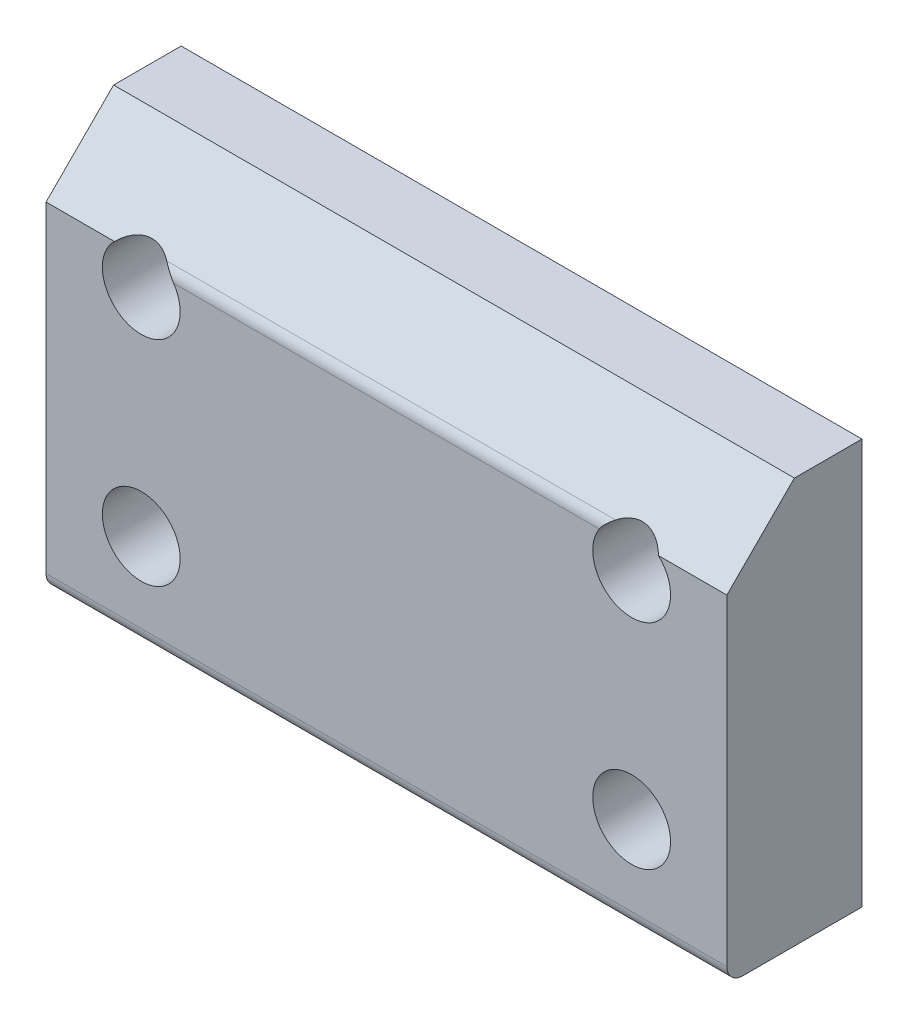
ISO-10303-21;
HEADER;
FILE_DESCRIPTION(('STEP AP214'),'2;1');
FILE_NAME('part.step','',(''),(''),'','','');
FILE_SCHEMA(('AUTOMOTIVE_DESIGN { 1 0 10303 214 1 1 1 1 }'));
ENDSEC;
DATA;
#1=APPLICATION_CONTEXT('core data for automotive mechanical design processes');
#2=APPLICATION_PROTOCOL_DEFINITION('international standard','automotive_design',2000,#1);
#3=PRODUCT_CONTEXT('',#1,'mechanical');
#4=PRODUCT('Part','Part','',(#3));
#5=PRODUCT_RELATED_PRODUCT_CATEGORY('part','',(#4));
#6=PRODUCT_DEFINITION_FORMATION('','',#4);
#7=PRODUCT_DEFINITION_CONTEXT('part definition',#1,'design');
#8=PRODUCT_DEFINITION('design','',#6,#7);
#9=PRODUCT_DEFINITION_SHAPE('','',#8);
#10=(LENGTH_UNIT() NAMED_UNIT(*) SI_UNIT(.MILLI.,.METRE.));
#11=(NAMED_UNIT(*) PLANE_ANGLE_UNIT() SI_UNIT($,.RADIAN.));
#12=(NAMED_UNIT(*) SI_UNIT($,.STERADIAN.) SOLID_ANGLE_UNIT());
#13=UNCERTAINTY_MEASURE_WITH_UNIT(LENGTH_MEASURE(1.E-05),#10,'distance_accuracy_value','');
#14=(GEOMETRIC_REPRESENTATION_CONTEXT(3) GLOBAL_UNCERTAINTY_ASSIGNED_CONTEXT((#13)) GLOBAL_UNIT_ASSIGNED_CONTEXT((#10,
#11,#12)) REPRESENTATION_CONTEXT('',''));
#15=CARTESIAN_POINT('',(0.,0.,0.));
#16=DIRECTION('',(0.,0.,1.));
#17=DIRECTION('',(1.,0.,0.));
#18=AXIS2_PLACEMENT_3D('',#15,#16,#17);
#19=CARTESIAN_POINT('',(16.,9.525,-6.35));
#20=DIRECTION('',(0.,0.,1.));
#21=DIRECTION('',(1.,0.,0.));
#22=AXIS2_PLACEMENT_3D('',#19,#20,#21);
#23=PLANE('',#22);
#24=CARTESIAN_POINT('',(11.525,5.025,-6.35));
#25=DIRECTION('',(0.,0.,-1.));
#26=DIRECTION('',(-1.,0.,0.));
#27=AXIS2_PLACEMENT_3D('',#24,#25,#26);
#28=CIRCLE('',#27,3.57251);
#29=CARTESIAN_POINT('',(7.95249,5.025,-6.35));
#30=VERTEX_POINT('',#29);
#31=EDGE_CURVE('E220',#30,#30,#28,.T.);
#32=ORIENTED_EDGE('',*,*,#31,.F.);
#33=EDGE_LOOP('',(#32));
#34=FACE_BOUND('',#33,.T.);
#35=CARTESIAN_POINT('',(11.525,-5.025,-6.35));
#36=DIRECTION('',(0.,0.,-1.));
#37=DIRECTION('',(-1.,0.,0.));
#38=AXIS2_PLACEMENT_3D('',#35,#36,#37);
#39=CIRCLE('',#38,3.57251);
#40=CARTESIAN_POINT('',(7.95249,-5.025,-6.35));
#41=VERTEX_POINT('',#40);
#42=EDGE_CURVE('E224',#41,#41,#39,.T.);
#43=ORIENTED_EDGE('',*,*,#42,.F.);
#44=EDGE_LOOP('',(#43));
#45=FACE_BOUND('',#44,.T.);
#46=CARTESIAN_POINT('',(-11.525,5.025,-6.35));
#47=DIRECTION('',(0.,0.,-1.));
#48=DIRECTION('',(-1.,0.,0.));
#49=AXIS2_PLACEMENT_3D('',#46,#47,#48);
#50=CIRCLE('',#49,3.57251);
#51=CARTESIAN_POINT('',(-15.09751,5.025,-6.35));
#52=VERTEX_POINT('',#51);
#53=EDGE_CURVE('E154',#52,#52,#50,.T.);
#54=ORIENTED_EDGE('',*,*,#53,.F.);
#55=EDGE_LOOP('',(#54));
#56=FACE_BOUND('',#55,.T.);
#57=CARTESIAN_POINT('',(-11.525,-5.025,-6.35));
#58=DIRECTION('',(0.,0.,-1.));
#59=DIRECTION('',(-1.,0.,0.));
#60=AXIS2_PLACEMENT_3D('',#57,#58,#59);
#61=CIRCLE('',#60,3.57251);
#62=CARTESIAN_POINT('',(-15.09751,-5.025,-6.35));
#63=VERTEX_POINT('',#62);
#64=EDGE_CURVE('E230',#63,#63,#61,.T.);
#65=ORIENTED_EDGE('',*,*,#64,.F.);
#66=EDGE_LOOP('',(#65));
#67=FACE_BOUND('',#66,.T.);
#68=DIRECTION('',(0.,1.,0.));
#69=VECTOR('',#68,1.);
#70=CARTESIAN_POINT('',(-16.,9.525,-6.35));
#71=LINE('',#70,#69);
#72=CARTESIAN_POINT('',(-16.,-9.525,-6.35));
#73=VERTEX_POINT('',#72);
#74=CARTESIAN_POINT('',(-16.,9.525,-6.35));
#75=VERTEX_POINT('',#74);
#76=EDGE_CURVE('E138',#73,#75,#71,.T.);
#77=ORIENTED_EDGE('',*,*,#76,.T.);
#78=DIRECTION('',(-1.,0.,0.));
#79=VECTOR('',#78,1.);
#80=CARTESIAN_POINT('',(16.,9.525,-6.35));
#81=LINE('',#80,#79);
#82=CARTESIAN_POINT('',(16.,9.525,-6.35));
#83=VERTEX_POINT('',#82);
#84=EDGE_CURVE('E121',#83,#75,#81,.T.);
#85=ORIENTED_EDGE('',*,*,#84,.F.);
#86=DIRECTION('',(0.,1.,0.));
#87=VECTOR('',#86,1.);
#88=CARTESIAN_POINT('',(16.,9.525,-6.35));
#89=LINE('',#88,#87);
#90=CARTESIAN_POINT('',(16.,-9.525,-6.35));
#91=VERTEX_POINT('',#90);
#92=EDGE_CURVE('E127',#91,#83,#89,.T.);
#93=ORIENTED_EDGE('',*,*,#92,.F.);
#94=DIRECTION('',(-1.,0.,0.));
#95=VECTOR('',#94,1.);
#96=CARTESIAN_POINT('',(16.,-9.525,-6.35));
#97=LINE('',#96,#95);
#98=EDGE_CURVE('E248',#91,#73,#97,.T.);
#99=ORIENTED_EDGE('',*,*,#98,.T.);
#100=EDGE_LOOP('',(#77,#85,#93,#99));
#101=FACE_BOUND('',#100,.T.);
#102=ADVANCED_FACE('F47',(#34,#45,#56,#67,#101),#23,.F.);
#103=CARTESIAN_POINT('',(16.,9.525,-3.175));
#104=DIRECTION('',(0.,-1.,0.));
#105=DIRECTION('',(0.,0.,-1.));
#106=AXIS2_PLACEMENT_3D('',#103,#104,#105);
#107=PLANE('',#106);
#108=DIRECTION('',(0.,0.,1.));
#109=VECTOR('',#108,1.);
#110=CARTESIAN_POINT('',(-16.,9.525,-3.175));
#111=LINE('',#110,#109);
#112=CARTESIAN_POINT('',(-16.,9.525,-3.175));
#113=VERTEX_POINT('',#112);
#114=EDGE_CURVE('E250',#75,#113,#111,.T.);
#115=ORIENTED_EDGE('',*,*,#114,.T.);
#116=DIRECTION('',(-1.,0.,0.));
#117=VECTOR('',#116,1.);
#118=CARTESIAN_POINT('',(16.,9.525,-3.175));
#119=LINE('',#118,#117);
#120=CARTESIAN_POINT('',(16.,9.525,-3.175));
#121=VERTEX_POINT('',#120);
#122=EDGE_CURVE('E124',#121,#113,#119,.T.);
#123=ORIENTED_EDGE('',*,*,#122,.F.);
#124=DIRECTION('',(0.,0.,1.));
#125=VECTOR('',#124,1.);
#126=CARTESIAN_POINT('',(16.,9.525,-3.175));
#127=LINE('',#126,#125);
#128=EDGE_CURVE('E117',#83,#121,#127,.T.);
#129=ORIENTED_EDGE('',*,*,#128,.F.);
#130=ORIENTED_EDGE('',*,*,#84,.T.);
#131=EDGE_LOOP('',(#115,#123,#129,#130));
#132=FACE_BOUND('',#131,.T.);
#133=ADVANCED_FACE('F119',(#132),#107,.F.);
#134=CARTESIAN_POINT('',(16.,6.34999999999997,0.));
#135=DIRECTION('',(0.,-0.707106781186544,-0.707106781186552));
#136=DIRECTION('',(0.,0.707106781186552,-0.707106781186544));
#137=AXIS2_PLACEMENT_3D('',#134,#135,#136);
#138=PLANE('',#137);
#139=CARTESIAN_POINT('',(-11.525,5.025,1.32499999999995));
#140=DIRECTION('',(0.,-0.707106781186544,-0.707106781186552));
#141=DIRECTION('',(0.,0.707106781186552,-0.707106781186544));
#142=AXIS2_PLACEMENT_3D('',#139,#140,#141);
#143=ELLIPSE('',#142,2.5863137628679,1.8288);
#144=CARTESIAN_POINT('',(-12.7855095953622,6.34999999999997,0.));
#145=VERTEX_POINT('',#144);
#146=CARTESIAN_POINT('',(-10.5459676734432,6.56966991411005,-0.219669914110087));
#147=VERTEX_POINT('',#146);
#148=EDGE_CURVE('E233',#145,#147,#143,.T.);
#149=ORIENTED_EDGE('',*,*,#148,.T.);
#150=DIRECTION('',(-1.,0.,0.));
#151=VECTOR('',#150,1.);
#152=CARTESIAN_POINT('',(16.,6.56966991411005,-0.219669914110087));
#153=LINE('',#152,#151);
#154=CARTESIAN_POINT('',(10.5459676734432,6.56966991411005,-0.219669914110086));
#155=VERTEX_POINT('',#154);
#156=EDGE_CURVE('E169',#147,#155,#153,.F.);
#157=ORIENTED_EDGE('',*,*,#156,.T.);
#158=CARTESIAN_POINT('',(11.525,5.025,1.32499999999995));
#159=DIRECTION('',(0.,-0.707106781186544,-0.707106781186552));
#160=DIRECTION('',(0.,0.707106781186552,-0.707106781186544));
#161=AXIS2_PLACEMENT_3D('',#158,#159,#160);
#162=ELLIPSE('',#161,2.5863137628679,1.8288);
#163=CARTESIAN_POINT('',(12.7855095953622,6.34999999999997,0.));
#164=VERTEX_POINT('',#163);
#165=EDGE_CURVE('E141',#155,#164,#162,.T.);
#166=ORIENTED_EDGE('',*,*,#165,.T.);
#167=DIRECTION('',(-1.,0.,0.));
#168=VECTOR('',#167,1.);
#169=CARTESIAN_POINT('',(16.,6.34999999999997,0.));
#170=LINE('',#169,#168);
#171=CARTESIAN_POINT('',(16.,6.34999999999997,0.));
#172=VERTEX_POINT('',#171);
#173=EDGE_CURVE('E143',#172,#164,#170,.T.);
#174=ORIENTED_EDGE('',*,*,#173,.F.);
#175=DIRECTION('',(0.,-0.707106781186551,0.707106781186544));
#176=VECTOR('',#175,1.);
#177=CARTESIAN_POINT('',(16.,6.34999999999997,0.));
#178=LINE('',#177,#176);
#179=EDGE_CURVE('E126',#121,#172,#178,.T.);
#180=ORIENTED_EDGE('',*,*,#179,.F.);
#181=ORIENTED_EDGE('',*,*,#122,.T.);
#182=DIRECTION('',(0.,-0.707106781186551,0.707106781186544));
#183=VECTOR('',#182,1.);
#184=CARTESIAN_POINT('',(-16.,6.34999999999997,0.));
#185=LINE('',#184,#183);
#186=CARTESIAN_POINT('',(-16.,6.34999999999997,0.));
#187=VERTEX_POINT('',#186);
#188=EDGE_CURVE('E252',#113,#187,#185,.T.);
#189=ORIENTED_EDGE('',*,*,#188,.T.);
#190=EDGE_CURVE('E259',#145,#187,#170,.T.);
#191=ORIENTED_EDGE('',*,*,#190,.F.);
#192=EDGE_LOOP('',(#149,#157,#166,#174,#180,#181,#189,#191));
#193=FACE_BOUND('',#192,.T.);
#194=ADVANCED_FACE('F207',(#193),#138,.F.);
#195=CARTESIAN_POINT('',(16.,6.34999999999997,0.));
#196=DIRECTION('',(0.,0.,-1.));
#197=DIRECTION('',(0.,1.,0.));
#198=AXIS2_PLACEMENT_3D('',#195,#196,#197);
#199=PLANE('',#198);
#200=CARTESIAN_POINT('',(11.525,-5.025,0.));
#201=DIRECTION('',(0.,0.,-1.));
#202=DIRECTION('',(0.,1.,0.));
#203=AXIS2_PLACEMENT_3D('',#200,#201,#202);
#204=CIRCLE('',#203,1.8288);
#205=CARTESIAN_POINT('',(11.525,-3.1962,0.));
#206=VERTEX_POINT('',#205);
#207=EDGE_CURVE('E151',#206,#206,#204,.T.);
#208=ORIENTED_EDGE('',*,*,#207,.T.);
#209=EDGE_LOOP('',(#208));
#210=FACE_BOUND('',#209,.T.);
#211=CARTESIAN_POINT('',(-11.525,-5.025,0.));
#212=DIRECTION('',(0.,0.,-1.));
#213=DIRECTION('',(0.,1.,0.));
#214=AXIS2_PLACEMENT_3D('',#211,#212,#213);
#215=CIRCLE('',#214,1.8288);
#216=CARTESIAN_POINT('',(-11.525,-3.1962,0.));
#217=VERTEX_POINT('',#216);
#218=EDGE_CURVE('E147',#217,#217,#215,.T.);
#219=ORIENTED_EDGE('',*,*,#218,.T.);
#220=EDGE_LOOP('',(#219));
#221=FACE_BOUND('',#220,.T.);
#222=CARTESIAN_POINT('',(11.525,5.025,0.));
#223=DIRECTION('',(0.,0.,-1.));
#224=DIRECTION('',(0.,1.,0.));
#225=AXIS2_PLACEMENT_3D('',#222,#223,#224);
#226=CIRCLE('',#225,1.8288);
#227=CARTESIAN_POINT('',(10.003282498988,6.03933982822015,0.));
#228=VERTEX_POINT('',#227);
#229=EDGE_CURVE('E324',#164,#228,#226,.T.);
#230=ORIENTED_EDGE('',*,*,#229,.T.);
#231=DIRECTION('',(-1.,0.,0.));
#232=VECTOR('',#231,1.);
#233=CARTESIAN_POINT('',(16.,6.03933982822015,0.));
#234=LINE('',#233,#232);
#235=CARTESIAN_POINT('',(-10.003282498988,6.03933982822015,0.));
#236=VERTEX_POINT('',#235);
#237=EDGE_CURVE('E159',#228,#236,#234,.T.);
#238=ORIENTED_EDGE('',*,*,#237,.T.);
#239=CARTESIAN_POINT('',(-11.525,5.025,0.));
#240=DIRECTION('',(0.,0.,-1.));
#241=DIRECTION('',(0.,1.,0.));
#242=AXIS2_PLACEMENT_3D('',#239,#240,#241);
#243=CIRCLE('',#242,1.8288);
#244=EDGE_CURVE('E139',#236,#145,#243,.T.);
#245=ORIENTED_EDGE('',*,*,#244,.T.);
#246=ORIENTED_EDGE('',*,*,#190,.T.);
#247=DIRECTION('',(0.,-1.,0.));
#248=VECTOR('',#247,1.);
#249=CARTESIAN_POINT('',(-16.,6.34999999999997,0.));
#250=LINE('',#249,#248);
#251=CARTESIAN_POINT('',(-16.,-8.775,0.));
#252=VERTEX_POINT('',#251);
#253=EDGE_CURVE('E255',#187,#252,#250,.T.);
#254=ORIENTED_EDGE('',*,*,#253,.T.);
#255=DIRECTION('',(-1.,0.,0.));
#256=VECTOR('',#255,1.);
#257=CARTESIAN_POINT('',(16.,-8.775,0.));
#258=LINE('',#257,#256);
#259=CARTESIAN_POINT('',(16.,-8.775,0.));
#260=VERTEX_POINT('',#259);
#261=EDGE_CURVE('E157',#252,#260,#258,.F.);
#262=ORIENTED_EDGE('',*,*,#261,.T.);
#263=DIRECTION('',(0.,-1.,0.));
#264=VECTOR('',#263,1.);
#265=CARTESIAN_POINT('',(16.,6.34999999999997,0.));
#266=LINE('',#265,#264);
#267=EDGE_CURVE('E245',#172,#260,#266,.T.);
#268=ORIENTED_EDGE('',*,*,#267,.F.);
#269=ORIENTED_EDGE('',*,*,#173,.T.);
#270=EDGE_LOOP('',(#230,#238,#245,#246,#254,#262,#268,#269));
#271=FACE_BOUND('',#270,.T.);
#272=ADVANCED_FACE('F203',(#210,#221,#271),#199,.F.);
#273=CARTESIAN_POINT('',(16.,-9.525,0.));
#274=DIRECTION('',(0.,1.,0.));
#275=DIRECTION('',(0.,0.,1.));
#276=AXIS2_PLACEMENT_3D('',#273,#274,#275);
#277=PLANE('',#276);
#278=DIRECTION('',(0.,0.,-1.));
#279=VECTOR('',#278,1.);
#280=CARTESIAN_POINT('',(16.,-9.525,0.));
#281=LINE('',#280,#279);
#282=CARTESIAN_POINT('',(16.,-9.525,-0.750000000000002));
#283=VERTEX_POINT('',#282);
#284=EDGE_CURVE('E131',#283,#91,#281,.T.);
#285=ORIENTED_EDGE('',*,*,#284,.F.);
#286=DIRECTION('',(-1.,0.,0.));
#287=VECTOR('',#286,1.);
#288=CARTESIAN_POINT('',(16.,-9.525,-0.750000000000002));
#289=LINE('',#288,#287);
#290=CARTESIAN_POINT('',(-16.,-9.525,-0.750000000000002));
#291=VERTEX_POINT('',#290);
#292=EDGE_CURVE('E271',#283,#291,#289,.T.);
#293=ORIENTED_EDGE('',*,*,#292,.T.);
#294=DIRECTION('',(0.,0.,-1.));
#295=VECTOR('',#294,1.);
#296=CARTESIAN_POINT('',(-16.,-9.525,0.));
#297=LINE('',#296,#295);
#298=EDGE_CURVE('E135',#291,#73,#297,.T.);
#299=ORIENTED_EDGE('',*,*,#298,.T.);
#300=ORIENTED_EDGE('',*,*,#98,.F.);
#301=EDGE_LOOP('',(#285,#293,#299,#300));
#302=FACE_BOUND('',#301,.T.);
#303=ADVANCED_FACE('F197',(#302),#277,.F.);
#304=CARTESIAN_POINT('',(16.,0.,0.));
#305=DIRECTION('',(1.,0.,0.));
#306=DIRECTION('',(0.,0.,-1.));
#307=AXIS2_PLACEMENT_3D('',#304,#305,#306);
#308=PLANE('',#307);
#309=ORIENTED_EDGE('',*,*,#267,.T.);
#310=CARTESIAN_POINT('',(16.,-8.775,-0.750000000000002));
#311=DIRECTION('',(1.,0.,0.));
#312=DIRECTION('',(0.,0.,-1.));
#313=AXIS2_PLACEMENT_3D('',#310,#311,#312);
#314=CIRCLE('',#313,0.75);
#315=EDGE_CURVE('E13',#260,#283,#314,.T.);
#316=ORIENTED_EDGE('',*,*,#315,.T.);
#317=ORIENTED_EDGE('',*,*,#284,.T.);
#318=ORIENTED_EDGE('',*,*,#92,.T.);
#319=ORIENTED_EDGE('',*,*,#128,.T.);
#320=ORIENTED_EDGE('',*,*,#179,.T.);
#321=EDGE_LOOP('',(#309,#316,#317,#318,#319,#320));
#322=FACE_BOUND('',#321,.T.);
#323=ADVANCED_FACE('F130',(#322),#308,.T.);
#324=CARTESIAN_POINT('',(-16.,0.,0.));
#325=DIRECTION('',(1.,0.,0.));
#326=DIRECTION('',(0.,0.,-1.));
#327=AXIS2_PLACEMENT_3D('',#324,#325,#326);
#328=PLANE('',#327);
#329=ORIENTED_EDGE('',*,*,#298,.F.);
#330=CARTESIAN_POINT('',(-16.,-8.775,-0.750000000000002));
#331=DIRECTION('',(1.,0.,0.));
#332=DIRECTION('',(0.,0.,-1.));
#333=AXIS2_PLACEMENT_3D('',#330,#331,#332);
#334=CIRCLE('',#333,0.75);
#335=EDGE_CURVE('E55',#291,#252,#334,.F.);
#336=ORIENTED_EDGE('',*,*,#335,.T.);
#337=ORIENTED_EDGE('',*,*,#253,.F.);
#338=ORIENTED_EDGE('',*,*,#188,.F.);
#339=ORIENTED_EDGE('',*,*,#114,.F.);
#340=ORIENTED_EDGE('',*,*,#76,.F.);
#341=EDGE_LOOP('',(#329,#336,#337,#338,#339,#340));
#342=FACE_BOUND('',#341,.T.);
#343=ADVANCED_FACE('F193',(#342),#328,.F.);
#344=CARTESIAN_POINT('',(-11.525,-5.025,-6.35));
#345=DIRECTION('',(0.,0.,-1.));
#346=DIRECTION('',(-1.,0.,0.));
#347=AXIS2_PLACEMENT_3D('',#344,#345,#346);
#348=CYLINDRICAL_SURFACE('',#347,1.8288);
#349=CARTESIAN_POINT('',(-11.525,-5.025,-3.81));
#350=DIRECTION('',(0.,0.,-1.));
#351=DIRECTION('',(-1.,0.,0.));
#352=AXIS2_PLACEMENT_3D('',#349,#350,#351);
#353=CIRCLE('',#352,1.8288);
#354=CARTESIAN_POINT('',(-13.3538,-5.025,-3.81));
#355=VERTEX_POINT('',#354);
#356=EDGE_CURVE('E149',#355,#355,#353,.T.);
#357=ORIENTED_EDGE('',*,*,#356,.T.);
#358=EDGE_LOOP('',(#357));
#359=FACE_BOUND('',#358,.T.);
#360=ORIENTED_EDGE('',*,*,#218,.F.);
#361=EDGE_LOOP('',(#360));
#362=FACE_BOUND('',#361,.T.);
#363=ADVANCED_FACE('F189',(#359,#362),#348,.F.);
#364=CARTESIAN_POINT('',(-9.6962,-5.025,-3.81));
#365=DIRECTION('',(0.,0.,1.));
#366=DIRECTION('',(1.,0.,0.));
#367=AXIS2_PLACEMENT_3D('',#364,#365,#366);
#368=PLANE('',#367);
#369=ORIENTED_EDGE('',*,*,#356,.F.);
#370=EDGE_LOOP('',(#369));
#371=FACE_BOUND('',#370,.T.);
#372=CARTESIAN_POINT('',(-11.525,-5.025,-3.81));
#373=DIRECTION('',(0.,0.,-1.));
#374=DIRECTION('',(-1.,0.,0.));
#375=AXIS2_PLACEMENT_3D('',#372,#373,#374);
#376=CIRCLE('',#375,3.57251);
#377=CARTESIAN_POINT('',(-15.09751,-5.025,-3.81));
#378=VERTEX_POINT('',#377);
#379=EDGE_CURVE('E232',#378,#378,#376,.T.);
#380=ORIENTED_EDGE('',*,*,#379,.T.);
#381=EDGE_LOOP('',(#380));
#382=FACE_BOUND('',#381,.T.);
#383=ADVANCED_FACE('F185',(#371,#382),#368,.F.);
#384=CARTESIAN_POINT('',(-11.525,-5.025,-6.35));
#385=DIRECTION('',(0.,0.,-1.));
#386=DIRECTION('',(-1.,0.,0.));
#387=AXIS2_PLACEMENT_3D('',#384,#385,#386);
#388=CYLINDRICAL_SURFACE('',#387,3.57251);
#389=ORIENTED_EDGE('',*,*,#379,.F.);
#390=EDGE_LOOP('',(#389));
#391=FACE_BOUND('',#390,.T.);
#392=ORIENTED_EDGE('',*,*,#64,.T.);
#393=EDGE_LOOP('',(#392));
#394=FACE_BOUND('',#393,.T.);
#395=ADVANCED_FACE('F180',(#391,#394),#388,.F.);
#396=CARTESIAN_POINT('',(-11.525,5.025,-6.35));
#397=DIRECTION('',(0.,0.,-1.));
#398=DIRECTION('',(-1.,0.,0.));
#399=AXIS2_PLACEMENT_3D('',#396,#397,#398);
#400=CYLINDRICAL_SURFACE('',#399,1.8288);
#401=CARTESIAN_POINT('',(-11.525,5.025,-3.81));
#402=DIRECTION('',(0.,0.,-1.));
#403=DIRECTION('',(-1.,0.,0.));
#404=AXIS2_PLACEMENT_3D('',#401,#402,#403);
#405=CIRCLE('',#404,1.8288);
#406=CARTESIAN_POINT('',(-13.3538,5.025,-3.81));
#407=VERTEX_POINT('',#406);
#408=EDGE_CURVE('E238',#407,#407,#405,.T.);
#409=ORIENTED_EDGE('',*,*,#408,.T.);
#410=EDGE_LOOP('',(#409));
#411=FACE_BOUND('',#410,.T.);
#412=ORIENTED_EDGE('',*,*,#244,.F.);
#413=CARTESIAN_POINT('',(-10.003282498988,6.03933982822015,0.));
#414=CARTESIAN_POINT('',(-10.0212425116719,6.06629310091701,-2.51963735137469E-06));
#415=CARTESIAN_POINT('',(-10.039906569203,6.09273169935019,-0.00145194159973827));
#416=CARTESIAN_POINT('',(-10.0784355436853,6.14437136449561,-0.00693751081503251));
#417=CARTESIAN_POINT('',(-10.0982982703906,6.1695745444536,-0.0109690622338227));
#418=CARTESIAN_POINT('',(-10.1585236794229,6.24201720270355,-0.0262452808843104));
#419=CARTESIAN_POINT('',(-10.2003767281767,6.28735765680942,-0.0407023770406284));
#420=CARTESIAN_POINT('',(-10.290887736311,6.37624977408328,-0.078037697826558));
#421=CARTESIAN_POINT('',(-10.33981603488,6.41923750512854,-0.10157707888605));
#422=CARTESIAN_POINT('',(-10.4153528123583,6.47905042802878,-0.141926972723034));
#423=CARTESIAN_POINT('',(-10.4412368721027,6.49842768153044,-0.156438094186994));
#424=CARTESIAN_POINT('',(-10.4933629775369,6.5353819584501,-0.186960539075913));
#425=CARTESIAN_POINT('',(-10.5196046917041,6.55296053551931,-0.202970544512961));
#426=CARTESIAN_POINT('',(-10.5459676734432,6.56966991411005,-0.219669914110087));
#427=B_SPLINE_CURVE_WITH_KNOTS('',3,(#413,#414,#415,#416,#417,#418,#419,#420,#421,#422,#423,
#424,#425,#426),.UNSPECIFIED.,.F.,.F.,(4,2,2,2,2,2,4),(0.,0.0970628040756524,0.193953328035096,
0.383217256416149,0.590182939042233,0.696438937202258,0.802602365263826),.UNSPECIFIED.);
#428=EDGE_CURVE('E162',#236,#147,#427,.T.);
#429=ORIENTED_EDGE('',*,*,#428,.T.);
#430=ORIENTED_EDGE('',*,*,#148,.F.);
#431=EDGE_LOOP('',(#412,#429,#430));
#432=FACE_BOUND('',#431,.T.);
#433=ADVANCED_FACE('F174',(#411,#432),#400,.F.);
#434=CARTESIAN_POINT('',(-9.6962,5.025,-3.81));
#435=DIRECTION('',(0.,0.,1.));
#436=DIRECTION('',(1.,0.,0.));
#437=AXIS2_PLACEMENT_3D('',#434,#435,#436);
#438=PLANE('',#437);
#439=ORIENTED_EDGE('',*,*,#408,.F.);
#440=EDGE_LOOP('',(#439));
#441=FACE_BOUND('',#440,.T.);
#442=CARTESIAN_POINT('',(-11.525,5.025,-3.81));
#443=DIRECTION('',(0.,0.,-1.));
#444=DIRECTION('',(-1.,0.,0.));
#445=AXIS2_PLACEMENT_3D('',#442,#443,#444);
#446=CIRCLE('',#445,3.57251);
#447=CARTESIAN_POINT('',(-15.09751,5.025,-3.81));
#448=VERTEX_POINT('',#447);
#449=EDGE_CURVE('E308',#448,#448,#446,.T.);
#450=ORIENTED_EDGE('',*,*,#449,.T.);
#451=EDGE_LOOP('',(#450));
#452=FACE_BOUND('',#451,.T.);
#453=ADVANCED_FACE('F179',(#441,#452),#438,.F.);
#454=CARTESIAN_POINT('',(-11.525,5.025,-6.35));
#455=DIRECTION('',(0.,0.,-1.));
#456=DIRECTION('',(-1.,0.,0.));
#457=AXIS2_PLACEMENT_3D('',#454,#455,#456);
#458=CYLINDRICAL_SURFACE('',#457,3.57251);
#459=ORIENTED_EDGE('',*,*,#449,.F.);
#460=EDGE_LOOP('',(#459));
#461=FACE_BOUND('',#460,.T.);
#462=ORIENTED_EDGE('',*,*,#53,.T.);
#463=EDGE_LOOP('',(#462));
#464=FACE_BOUND('',#463,.T.);
#465=ADVANCED_FACE('F297',(#461,#464),#458,.F.);
#466=CARTESIAN_POINT('',(11.525,-5.025,-6.35));
#467=DIRECTION('',(0.,0.,-1.));
#468=DIRECTION('',(-1.,0.,0.));
#469=AXIS2_PLACEMENT_3D('',#466,#467,#468);
#470=CYLINDRICAL_SURFACE('',#469,1.8288);
#471=CARTESIAN_POINT('',(11.525,-5.025,-3.81));
#472=DIRECTION('',(0.,0.,-1.));
#473=DIRECTION('',(-1.,0.,0.));
#474=AXIS2_PLACEMENT_3D('',#471,#472,#473);
#475=CIRCLE('',#474,1.8288);
#476=CARTESIAN_POINT('',(9.6962,-5.025,-3.81));
#477=VERTEX_POINT('',#476);
#478=EDGE_CURVE('E155',#477,#477,#475,.T.);
#479=ORIENTED_EDGE('',*,*,#478,.T.);
#480=EDGE_LOOP('',(#479));
#481=FACE_BOUND('',#480,.T.);
#482=ORIENTED_EDGE('',*,*,#207,.F.);
#483=EDGE_LOOP('',(#482));
#484=FACE_BOUND('',#483,.T.);
#485=ADVANCED_FACE('F294',(#481,#484),#470,.F.);
#486=CARTESIAN_POINT('',(13.3538,-5.025,-3.81));
#487=DIRECTION('',(0.,0.,1.));
#488=DIRECTION('',(1.,0.,0.));
#489=AXIS2_PLACEMENT_3D('',#486,#487,#488);
#490=PLANE('',#489);
#491=ORIENTED_EDGE('',*,*,#478,.F.);
#492=EDGE_LOOP('',(#491));
#493=FACE_BOUND('',#492,.T.);
#494=CARTESIAN_POINT('',(11.525,-5.025,-3.81));
#495=DIRECTION('',(0.,0.,-1.));
#496=DIRECTION('',(-1.,0.,0.));
#497=AXIS2_PLACEMENT_3D('',#494,#495,#496);
#498=CIRCLE('',#497,3.57251);
#499=CARTESIAN_POINT('',(7.95249,-5.025,-3.81));
#500=VERTEX_POINT('',#499);
#501=EDGE_CURVE('E327',#500,#500,#498,.T.);
#502=ORIENTED_EDGE('',*,*,#501,.T.);
#503=EDGE_LOOP('',(#502));
#504=FACE_BOUND('',#503,.T.);
#505=ADVANCED_FACE('F290',(#493,#504),#490,.F.);
#506=CARTESIAN_POINT('',(11.525,-5.025,-6.35));
#507=DIRECTION('',(0.,0.,-1.));
#508=DIRECTION('',(-1.,0.,0.));
#509=AXIS2_PLACEMENT_3D('',#506,#507,#508);
#510=CYLINDRICAL_SURFACE('',#509,3.57251);
#511=ORIENTED_EDGE('',*,*,#501,.F.);
#512=EDGE_LOOP('',(#511));
#513=FACE_BOUND('',#512,.T.);
#514=ORIENTED_EDGE('',*,*,#42,.T.);
#515=EDGE_LOOP('',(#514));
#516=FACE_BOUND('',#515,.T.);
#517=ADVANCED_FACE('F285',(#513,#516),#510,.F.);
#518=CARTESIAN_POINT('',(11.525,5.025,-6.35));
#519=DIRECTION('',(0.,0.,-1.));
#520=DIRECTION('',(-1.,0.,0.));
#521=AXIS2_PLACEMENT_3D('',#518,#519,#520);
#522=CYLINDRICAL_SURFACE('',#521,1.8288);
#523=CARTESIAN_POINT('',(11.525,5.025,-3.81));
#524=DIRECTION('',(0.,0.,-1.));
#525=DIRECTION('',(-1.,0.,0.));
#526=AXIS2_PLACEMENT_3D('',#523,#524,#525);
#527=CIRCLE('',#526,1.8288);
#528=CARTESIAN_POINT('',(9.6962,5.025,-3.81));
#529=VERTEX_POINT('',#528);
#530=EDGE_CURVE('E325',#529,#529,#527,.T.);
#531=ORIENTED_EDGE('',*,*,#530,.T.);
#532=EDGE_LOOP('',(#531));
#533=FACE_BOUND('',#532,.T.);
#534=ORIENTED_EDGE('',*,*,#165,.F.);
#535=CARTESIAN_POINT('',(10.5459676734432,6.56966991411005,-0.219669914110087));
#536=CARTESIAN_POINT('',(10.5140065307929,6.54941555881121,-0.19943542505144));
#537=CARTESIAN_POINT('',(10.4822085181986,6.52786791854307,-0.180188826159895));
#538=CARTESIAN_POINT('',(10.4191418187422,6.48208856498599,-0.143918530952238));
#539=CARTESIAN_POINT('',(10.3878746447522,6.45785031057199,-0.12690048123863));
#540=CARTESIAN_POINT('',(10.3272211873249,6.40751147118546,-0.095941617732929));
#541=CARTESIAN_POINT('',(10.2978067349171,6.38149535566288,-0.0819197269086042));
#542=CARTESIAN_POINT('',(10.240130703541,6.32699659355717,-0.0567072616930883));
#543=CARTESIAN_POINT('',(10.2118678792755,6.29851672117044,-0.045513557055524));
#544=CARTESIAN_POINT('',(10.1520339697879,6.23401412457983,-0.024784512380746));
#545=CARTESIAN_POINT('',(10.1207287072876,6.19753612797132,-0.0158644624664473));
#546=CARTESIAN_POINT('',(10.0601219814737,6.12094838848744,-0.00342827285811977));
#547=CARTESIAN_POINT('',(10.0308700084813,6.08078272883862,-1.82378273251941E-05));
#548=CARTESIAN_POINT('',(10.003282498988,6.03933982822015,0.));
#549=B_SPLINE_CURVE_WITH_KNOTS('',3,(#535,#536,#537,#538,#539,#540,#541,#542,#543,#544,#545,
#546,#547,#548),.UNSPECIFIED.,.F.,.F.,(4,2,2,2,2,2,4),(0.,0.12873061776087,0.257781344170416,
0.382700372087978,0.507480527467547,0.653697872867098,0.802698700146841),.UNSPECIFIED.);
#550=EDGE_CURVE('E272',#155,#228,#549,.T.);
#551=ORIENTED_EDGE('',*,*,#550,.T.);
#552=ORIENTED_EDGE('',*,*,#229,.F.);
#553=EDGE_LOOP('',(#534,#551,#552));
#554=FACE_BOUND('',#553,.T.);
#555=ADVANCED_FACE('F279',(#533,#554),#522,.F.);
#556=CARTESIAN_POINT('',(13.3538,5.025,-3.81));
#557=DIRECTION('',(0.,0.,1.));
#558=DIRECTION('',(1.,0.,0.));
#559=AXIS2_PLACEMENT_3D('',#556,#557,#558);
#560=PLANE('',#559);
#561=ORIENTED_EDGE('',*,*,#530,.F.);
#562=EDGE_LOOP('',(#561));
#563=FACE_BOUND('',#562,.T.);
#564=CARTESIAN_POINT('',(11.525,5.025,-3.81));
#565=DIRECTION('',(0.,0.,-1.));
#566=DIRECTION('',(-1.,0.,0.));
#567=AXIS2_PLACEMENT_3D('',#564,#565,#566);
#568=CIRCLE('',#567,3.57251);
#569=CARTESIAN_POINT('',(7.95249,5.025,-3.81));
#570=VERTEX_POINT('',#569);
#571=EDGE_CURVE('E330',#570,#570,#568,.T.);
#572=ORIENTED_EDGE('',*,*,#571,.T.);
#573=EDGE_LOOP('',(#572));
#574=FACE_BOUND('',#573,.T.);
#575=ADVANCED_FACE('F284',(#563,#574),#560,.F.);
#576=CARTESIAN_POINT('',(11.525,5.025,-6.35));
#577=DIRECTION('',(0.,0.,-1.));
#578=DIRECTION('',(-1.,0.,0.));
#579=AXIS2_PLACEMENT_3D('',#576,#577,#578);
#580=CYLINDRICAL_SURFACE('',#579,3.57251);
#581=ORIENTED_EDGE('',*,*,#571,.F.);
#582=EDGE_LOOP('',(#581));
#583=FACE_BOUND('',#582,.T.);
#584=ORIENTED_EDGE('',*,*,#31,.T.);
#585=EDGE_LOOP('',(#584));
#586=FACE_BOUND('',#585,.T.);
#587=ADVANCED_FACE('F347',(#583,#586),#580,.F.);
#588=CARTESIAN_POINT('',(16.,6.03933982822015,-0.75));
#589=DIRECTION('',(-1.,0.,0.));
#590=DIRECTION('',(0.,0.,1.));
#591=AXIS2_PLACEMENT_3D('',#588,#589,#590);
#592=CYLINDRICAL_SURFACE('',#591,0.75);
#593=ORIENTED_EDGE('',*,*,#550,.F.);
#594=ORIENTED_EDGE('',*,*,#156,.F.);
#595=ORIENTED_EDGE('',*,*,#428,.F.);
#596=ORIENTED_EDGE('',*,*,#237,.F.);
#597=EDGE_LOOP('',(#593,#594,#595,#596));
#598=FACE_BOUND('',#597,.T.);
#599=ADVANCED_FACE('F171',(#598),#592,.T.);
#600=CARTESIAN_POINT('',(16.,-8.775,-0.750000000000002));
#601=DIRECTION('',(-1.,0.,0.));
#602=DIRECTION('',(0.,0.,1.));
#603=AXIS2_PLACEMENT_3D('',#600,#601,#602);
#604=CYLINDRICAL_SURFACE('',#603,0.75);
#605=ORIENTED_EDGE('',*,*,#315,.F.);
#606=ORIENTED_EDGE('',*,*,#261,.F.);
#607=ORIENTED_EDGE('',*,*,#335,.F.);
#608=ORIENTED_EDGE('',*,*,#292,.F.);
#609=EDGE_LOOP('',(#605,#606,#607,#608));
#610=FACE_BOUND('',#609,.T.);
#611=ADVANCED_FACE('F49',(#610),#604,.T.);
#612=CLOSED_SHELL('',(#102,#133,#194,#272,#303,#323,#343,#363,#383,#395,#433,#453,#465,#485,
#505,#517,#555,#575,#587,#599,#611));
#613=MANIFOLD_SOLID_BREP('B2',#612);
#614=ADVANCED_BREP_SHAPE_REPRESENTATION('',(#18,#613),#14);
#615=SHAPE_DEFINITION_REPRESENTATION(#9,#614);
ENDSEC;
END-ISO-10303-21;
